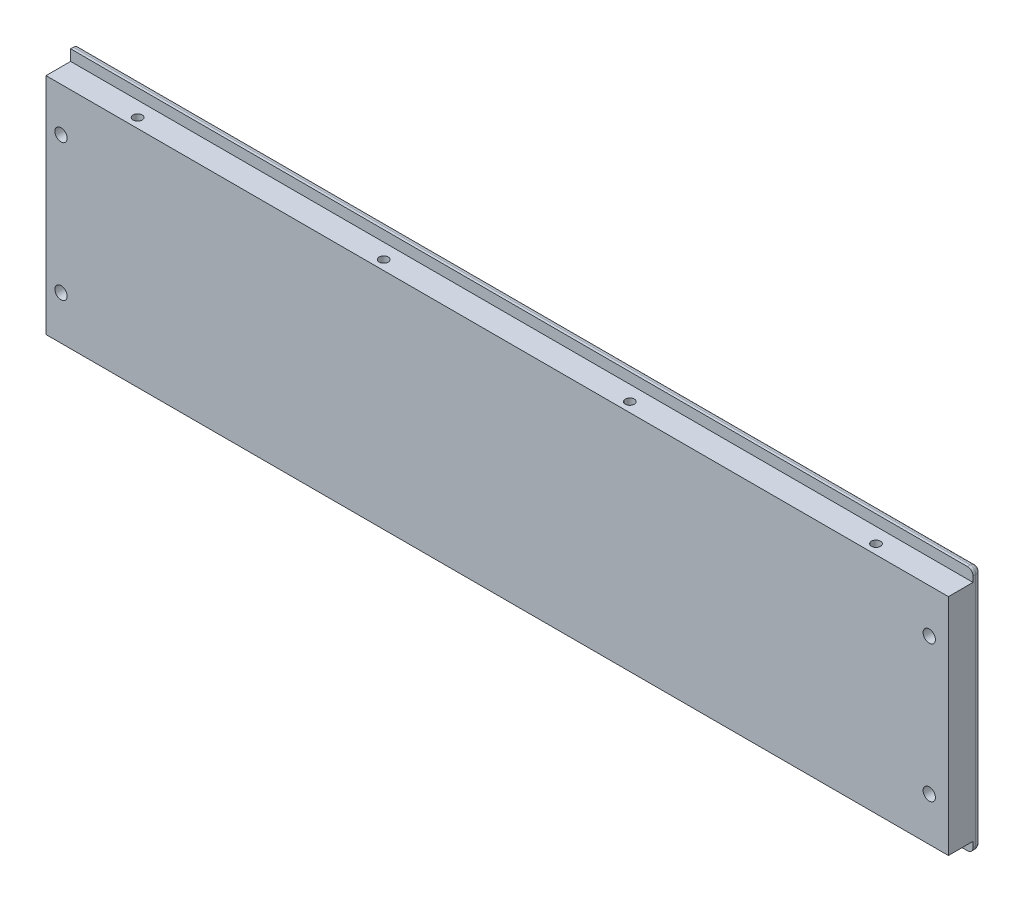
ISO-10303-21;
HEADER;
FILE_DESCRIPTION(('STEP AP214'),'2;1');
FILE_NAME('part.step','',(''),(''),'','','');
FILE_SCHEMA(('AUTOMOTIVE_DESIGN { 1 0 10303 214 1 1 1 1 }'));
ENDSEC;
DATA;
#1=APPLICATION_CONTEXT('core data for automotive mechanical design processes');
#2=APPLICATION_PROTOCOL_DEFINITION('international standard','automotive_design',2000,#1);
#3=PRODUCT_CONTEXT('',#1,'mechanical');
#4=PRODUCT('Part','Part','',(#3));
#5=PRODUCT_RELATED_PRODUCT_CATEGORY('part','',(#4));
#6=PRODUCT_DEFINITION_FORMATION('','',#4);
#7=PRODUCT_DEFINITION_CONTEXT('part definition',#1,'design');
#8=PRODUCT_DEFINITION('design','',#6,#7);
#9=PRODUCT_DEFINITION_SHAPE('','',#8);
#10=(LENGTH_UNIT() NAMED_UNIT(*) SI_UNIT(.MILLI.,.METRE.));
#11=(NAMED_UNIT(*) PLANE_ANGLE_UNIT() SI_UNIT($,.RADIAN.));
#12=(NAMED_UNIT(*) SI_UNIT($,.STERADIAN.) SOLID_ANGLE_UNIT());
#13=UNCERTAINTY_MEASURE_WITH_UNIT(LENGTH_MEASURE(1.E-05),#10,'distance_accuracy_value','');
#14=(GEOMETRIC_REPRESENTATION_CONTEXT(3) GLOBAL_UNCERTAINTY_ASSIGNED_CONTEXT((#13)) GLOBAL_UNIT_ASSIGNED_CONTEXT((#10,
#11,#12)) REPRESENTATION_CONTEXT('',''));
#15=CARTESIAN_POINT('',(0.,0.,0.));
#16=DIRECTION('',(0.,0.,1.));
#17=DIRECTION('',(1.,0.,0.));
#18=AXIS2_PLACEMENT_3D('',#15,#16,#17);
#19=CARTESIAN_POINT('',(0.,0.,12.));
#20=DIRECTION('',(1.,0.,0.));
#21=DIRECTION('',(0.,0.,-1.));
#22=AXIS2_PLACEMENT_3D('',#19,#20,#21);
#23=PLANE('',#22);
#24=DIRECTION('',(0.,-1.,0.));
#25=VECTOR('',#24,1.);
#26=CARTESIAN_POINT('',(0.,0.,0.));
#27=LINE('',#26,#25);
#28=CARTESIAN_POINT('',(0.,88.,0.));
#29=VERTEX_POINT('',#28);
#30=CARTESIAN_POINT('',(0.,2.,0.));
#31=VERTEX_POINT('',#30);
#32=EDGE_CURVE('E159',#29,#31,#27,.T.);
#33=ORIENTED_EDGE('',*,*,#32,.T.);
#34=CARTESIAN_POINT('',(0.,2.,2.));
#35=DIRECTION('',(1.,0.,0.));
#36=DIRECTION('',(0.,0.,-1.));
#37=AXIS2_PLACEMENT_3D('',#34,#35,#36);
#38=CIRCLE('',#37,2.);
#39=CARTESIAN_POINT('',(0.,0.,2.));
#40=VERTEX_POINT('',#39);
#41=EDGE_CURVE('E200',#31,#40,#38,.F.);
#42=ORIENTED_EDGE('',*,*,#41,.T.);
#43=DIRECTION('',(0.,0.,-1.));
#44=VECTOR('',#43,1.);
#45=CARTESIAN_POINT('',(0.,0.,12.));
#46=LINE('',#45,#44);
#47=CARTESIAN_POINT('',(0.,0.,3.));
#48=VERTEX_POINT('',#47);
#49=EDGE_CURVE('E188',#48,#40,#46,.T.);
#50=ORIENTED_EDGE('',*,*,#49,.F.);
#51=DIRECTION('',(0.,-1.,0.));
#52=VECTOR('',#51,1.);
#53=CARTESIAN_POINT('',(0.,0.,3.));
#54=LINE('',#53,#52);
#55=CARTESIAN_POINT('',(0.,4.,3.));
#56=VERTEX_POINT('',#55);
#57=EDGE_CURVE('E165',#56,#48,#54,.T.);
#58=ORIENTED_EDGE('',*,*,#57,.F.);
#59=DIRECTION('',(0.,0.,-1.));
#60=VECTOR('',#59,1.);
#61=CARTESIAN_POINT('',(0.,4.,12.));
#62=LINE('',#61,#60);
#63=CARTESIAN_POINT('',(0.,4.,12.));
#64=VERTEX_POINT('',#63);
#65=EDGE_CURVE('E169',#64,#56,#62,.T.);
#66=ORIENTED_EDGE('',*,*,#65,.F.);
#67=DIRECTION('',(0.,-1.,0.));
#68=VECTOR('',#67,1.);
#69=CARTESIAN_POINT('',(0.,0.,12.));
#70=LINE('',#69,#68);
#71=CARTESIAN_POINT('',(0.,86.,12.));
#72=VERTEX_POINT('',#71);
#73=EDGE_CURVE('E178',#72,#64,#70,.T.);
#74=ORIENTED_EDGE('',*,*,#73,.F.);
#75=DIRECTION('',(0.,0.,1.));
#76=VECTOR('',#75,1.);
#77=CARTESIAN_POINT('',(0.,86.,12.));
#78=LINE('',#77,#76);
#79=CARTESIAN_POINT('',(0.,86.,3.));
#80=VERTEX_POINT('',#79);
#81=EDGE_CURVE('E138',#80,#72,#78,.T.);
#82=ORIENTED_EDGE('',*,*,#81,.F.);
#83=DIRECTION('',(0.,-1.,0.));
#84=VECTOR('',#83,1.);
#85=CARTESIAN_POINT('',(0.,90.,3.));
#86=LINE('',#85,#84);
#87=CARTESIAN_POINT('',(0.,90.,3.));
#88=VERTEX_POINT('',#87);
#89=EDGE_CURVE('E144',#88,#80,#86,.T.);
#90=ORIENTED_EDGE('',*,*,#89,.F.);
#91=DIRECTION('',(0.,0.,-1.));
#92=VECTOR('',#91,1.);
#93=CARTESIAN_POINT('',(0.,90.,12.));
#94=LINE('',#93,#92);
#95=CARTESIAN_POINT('',(0.,90.,2.));
#96=VERTEX_POINT('',#95);
#97=EDGE_CURVE('E183',#88,#96,#94,.T.);
#98=ORIENTED_EDGE('',*,*,#97,.T.);
#99=CARTESIAN_POINT('',(0.,88.,2.));
#100=DIRECTION('',(1.,0.,0.));
#101=DIRECTION('',(0.,0.,-1.));
#102=AXIS2_PLACEMENT_3D('',#99,#100,#101);
#103=CIRCLE('',#102,2.);
#104=EDGE_CURVE('E198',#96,#29,#103,.F.);
#105=ORIENTED_EDGE('',*,*,#104,.T.);
#106=EDGE_LOOP('',(#33,#42,#50,#58,#66,#74,#82,#90,#98,#105));
#107=FACE_BOUND('',#106,.T.);
#108=ADVANCED_FACE('F36',(#107),#23,.F.);
#109=CARTESIAN_POINT('',(0.,0.,12.));
#110=DIRECTION('',(0.,1.,0.));
#111=DIRECTION('',(0.,0.,1.));
#112=AXIS2_PLACEMENT_3D('',#109,#110,#111);
#113=PLANE('',#112);
#114=DIRECTION('',(1.,0.,0.));
#115=VECTOR('',#114,1.);
#116=CARTESIAN_POINT('',(330.,0.,2.));
#117=LINE('',#116,#115);
#118=CARTESIAN_POINT('',(328.,0.,2.));
#119=VERTEX_POINT('',#118);
#120=EDGE_CURVE('E191',#40,#119,#117,.T.);
#121=ORIENTED_EDGE('',*,*,#120,.T.);
#122=DIRECTION('',(0.,0.,-1.));
#123=VECTOR('',#122,1.);
#124=CARTESIAN_POINT('',(328.,0.,12.));
#125=LINE('',#124,#123);
#126=CARTESIAN_POINT('',(328.,0.,3.));
#127=VERTEX_POINT('',#126);
#128=EDGE_CURVE('E45',#119,#127,#125,.F.);
#129=ORIENTED_EDGE('',*,*,#128,.T.);
#130=DIRECTION('',(-1.,0.,0.));
#131=VECTOR('',#130,1.);
#132=CARTESIAN_POINT('',(330.,0.,3.));
#133=LINE('',#132,#131);
#134=EDGE_CURVE('E157',#127,#48,#133,.T.);
#135=ORIENTED_EDGE('',*,*,#134,.T.);
#136=ORIENTED_EDGE('',*,*,#49,.T.);
#137=EDGE_LOOP('',(#121,#129,#135,#136));
#138=FACE_BOUND('',#137,.T.);
#139=ADVANCED_FACE('F252',(#138),#113,.F.);
#140=CARTESIAN_POINT('',(330.,0.,12.));
#141=DIRECTION('',(-1.,0.,0.));
#142=DIRECTION('',(0.,0.,1.));
#143=AXIS2_PLACEMENT_3D('',#140,#141,#142);
#144=PLANE('',#143);
#145=DIRECTION('',(0.,1.,0.));
#146=VECTOR('',#145,1.);
#147=CARTESIAN_POINT('',(330.,88.,2.));
#148=LINE('',#147,#146);
#149=CARTESIAN_POINT('',(330.,2.,2.));
#150=VERTEX_POINT('',#149);
#151=CARTESIAN_POINT('',(330.,88.,2.));
#152=VERTEX_POINT('',#151);
#153=EDGE_CURVE('E209',#150,#152,#148,.T.);
#154=ORIENTED_EDGE('',*,*,#153,.T.);
#155=DIRECTION('',(0.,0.,-1.));
#156=VECTOR('',#155,1.);
#157=CARTESIAN_POINT('',(330.,88.,12.));
#158=LINE('',#157,#156);
#159=CARTESIAN_POINT('',(330.,88.,3.));
#160=VERTEX_POINT('',#159);
#161=EDGE_CURVE('E135',#152,#160,#158,.F.);
#162=ORIENTED_EDGE('',*,*,#161,.T.);
#163=DIRECTION('',(0.,-1.,0.));
#164=VECTOR('',#163,1.);
#165=CARTESIAN_POINT('',(330.,90.,3.));
#166=LINE('',#165,#164);
#167=CARTESIAN_POINT('',(330.,86.,3.));
#168=VERTEX_POINT('',#167);
#169=EDGE_CURVE('E127',#160,#168,#166,.T.);
#170=ORIENTED_EDGE('',*,*,#169,.T.);
#171=DIRECTION('',(0.,0.,1.));
#172=VECTOR('',#171,1.);
#173=CARTESIAN_POINT('',(330.,86.,12.));
#174=LINE('',#173,#172);
#175=CARTESIAN_POINT('',(330.,86.,12.));
#176=VERTEX_POINT('',#175);
#177=EDGE_CURVE('E132',#168,#176,#174,.T.);
#178=ORIENTED_EDGE('',*,*,#177,.T.);
#179=DIRECTION('',(0.,1.,0.));
#180=VECTOR('',#179,1.);
#181=CARTESIAN_POINT('',(330.,0.,12.));
#182=LINE('',#181,#180);
#183=CARTESIAN_POINT('',(330.,4.,12.));
#184=VERTEX_POINT('',#183);
#185=EDGE_CURVE('E181',#184,#176,#182,.T.);
#186=ORIENTED_EDGE('',*,*,#185,.F.);
#187=DIRECTION('',(0.,0.,-1.));
#188=VECTOR('',#187,1.);
#189=CARTESIAN_POINT('',(330.,4.,12.));
#190=LINE('',#189,#188);
#191=CARTESIAN_POINT('',(330.,4.,3.));
#192=VERTEX_POINT('',#191);
#193=EDGE_CURVE('E161',#184,#192,#190,.T.);
#194=ORIENTED_EDGE('',*,*,#193,.T.);
#195=DIRECTION('',(0.,-1.,0.));
#196=VECTOR('',#195,1.);
#197=CARTESIAN_POINT('',(330.,0.,3.));
#198=LINE('',#197,#196);
#199=CARTESIAN_POINT('',(330.,2.,3.));
#200=VERTEX_POINT('',#199);
#201=EDGE_CURVE('E164',#192,#200,#198,.T.);
#202=ORIENTED_EDGE('',*,*,#201,.T.);
#203=DIRECTION('',(0.,0.,-1.));
#204=VECTOR('',#203,1.);
#205=CARTESIAN_POINT('',(330.,2.,12.));
#206=LINE('',#205,#204);
#207=EDGE_CURVE('E207',#200,#150,#206,.T.);
#208=ORIENTED_EDGE('',*,*,#207,.T.);
#209=EDGE_LOOP('',(#154,#162,#170,#178,#186,#194,#202,#208));
#210=FACE_BOUND('',#209,.T.);
#211=ADVANCED_FACE('F129',(#210),#144,.F.);
#212=CARTESIAN_POINT('',(0.,90.,12.));
#213=DIRECTION('',(0.,-1.,0.));
#214=DIRECTION('',(0.,0.,-1.));
#215=AXIS2_PLACEMENT_3D('',#212,#213,#214);
#216=PLANE('',#215);
#217=DIRECTION('',(-1.,0.,0.));
#218=VECTOR('',#217,1.);
#219=CARTESIAN_POINT('',(330.,90.,3.));
#220=LINE('',#219,#218);
#221=CARTESIAN_POINT('',(328.,90.,3.));
#222=VERTEX_POINT('',#221);
#223=EDGE_CURVE('E148',#222,#88,#220,.T.);
#224=ORIENTED_EDGE('',*,*,#223,.F.);
#225=DIRECTION('',(0.,0.,-1.));
#226=VECTOR('',#225,1.);
#227=CARTESIAN_POINT('',(328.,90.,12.));
#228=LINE('',#227,#226);
#229=CARTESIAN_POINT('',(328.,90.,2.));
#230=VERTEX_POINT('',#229);
#231=EDGE_CURVE('E204',#222,#230,#228,.T.);
#232=ORIENTED_EDGE('',*,*,#231,.T.);
#233=DIRECTION('',(-1.,0.,0.));
#234=VECTOR('',#233,1.);
#235=CARTESIAN_POINT('',(0.,90.,2.));
#236=LINE('',#235,#234);
#237=EDGE_CURVE('E202',#230,#96,#236,.T.);
#238=ORIENTED_EDGE('',*,*,#237,.T.);
#239=ORIENTED_EDGE('',*,*,#97,.F.);
#240=EDGE_LOOP('',(#224,#232,#238,#239));
#241=FACE_BOUND('',#240,.T.);
#242=ADVANCED_FACE('F274',(#241),#216,.F.);
#243=CARTESIAN_POINT('',(0.,0.,12.));
#244=DIRECTION('',(0.,0.,-1.));
#245=DIRECTION('',(-1.,0.,0.));
#246=AXIS2_PLACEMENT_3D('',#243,#244,#245);
#247=PLANE('',#246);
#248=CARTESIAN_POINT('',(323.,20.,12.));
#249=DIRECTION('',(0.,0.,-1.));
#250=DIRECTION('',(-1.,0.,0.));
#251=AXIS2_PLACEMENT_3D('',#248,#249,#250);
#252=CIRCLE('',#251,2.24999999999997);
#253=CARTESIAN_POINT('',(320.75,20.,12.));
#254=VERTEX_POINT('',#253);
#255=EDGE_CURVE('E495',#254,#254,#252,.T.);
#256=ORIENTED_EDGE('',*,*,#255,.T.);
#257=EDGE_LOOP('',(#256));
#258=FACE_BOUND('',#257,.T.);
#259=CARTESIAN_POINT('',(323.,70.,12.));
#260=DIRECTION('',(0.,0.,-1.));
#261=DIRECTION('',(-1.,0.,0.));
#262=AXIS2_PLACEMENT_3D('',#259,#260,#261);
#263=CIRCLE('',#262,2.24999999999997);
#264=CARTESIAN_POINT('',(320.75,70.,12.));
#265=VERTEX_POINT('',#264);
#266=EDGE_CURVE('E506',#265,#265,#263,.T.);
#267=ORIENTED_EDGE('',*,*,#266,.T.);
#268=EDGE_LOOP('',(#267));
#269=FACE_BOUND('',#268,.T.);
#270=CARTESIAN_POINT('',(5.5,20.,12.));
#271=DIRECTION('',(0.,0.,-1.));
#272=DIRECTION('',(-1.,0.,0.));
#273=AXIS2_PLACEMENT_3D('',#270,#271,#272);
#274=CIRCLE('',#273,2.25);
#275=CARTESIAN_POINT('',(3.25,20.,12.));
#276=VERTEX_POINT('',#275);
#277=EDGE_CURVE('E515',#276,#276,#274,.T.);
#278=ORIENTED_EDGE('',*,*,#277,.T.);
#279=EDGE_LOOP('',(#278));
#280=FACE_BOUND('',#279,.T.);
#281=CARTESIAN_POINT('',(5.5,70.,12.));
#282=DIRECTION('',(0.,0.,-1.));
#283=DIRECTION('',(-1.,0.,0.));
#284=AXIS2_PLACEMENT_3D('',#281,#282,#283);
#285=CIRCLE('',#284,2.25);
#286=CARTESIAN_POINT('',(3.25,70.,12.));
#287=VERTEX_POINT('',#286);
#288=EDGE_CURVE('E524',#287,#287,#285,.T.);
#289=ORIENTED_EDGE('',*,*,#288,.T.);
#290=EDGE_LOOP('',(#289));
#291=FACE_BOUND('',#290,.T.);
#292=ORIENTED_EDGE('',*,*,#185,.T.);
#293=DIRECTION('',(-1.,0.,0.));
#294=VECTOR('',#293,1.);
#295=CARTESIAN_POINT('',(330.,86.,12.));
#296=LINE('',#295,#294);
#297=EDGE_CURVE('E147',#176,#72,#296,.T.);
#298=ORIENTED_EDGE('',*,*,#297,.T.);
#299=ORIENTED_EDGE('',*,*,#73,.T.);
#300=DIRECTION('',(-1.,0.,0.));
#301=VECTOR('',#300,1.);
#302=CARTESIAN_POINT('',(330.,4.,12.));
#303=LINE('',#302,#301);
#304=EDGE_CURVE('E168',#184,#64,#303,.T.);
#305=ORIENTED_EDGE('',*,*,#304,.F.);
#306=EDGE_LOOP('',(#292,#298,#299,#305));
#307=FACE_BOUND('',#306,.T.);
#308=ADVANCED_FACE('F246',(#258,#269,#280,#291,#307),#247,.F.);
#309=CARTESIAN_POINT('',(0.,0.,0.));
#310=DIRECTION('',(0.,0.,-1.));
#311=DIRECTION('',(-1.,0.,0.));
#312=AXIS2_PLACEMENT_3D('',#309,#310,#311);
#313=PLANE('',#312);
#314=CARTESIAN_POINT('',(323.,20.,0.));
#315=DIRECTION('',(0.,0.,-1.));
#316=DIRECTION('',(-1.,0.,0.));
#317=AXIS2_PLACEMENT_3D('',#314,#315,#316);
#318=CIRCLE('',#317,4.69999999999998);
#319=CARTESIAN_POINT('',(318.3,20.,0.));
#320=VERTEX_POINT('',#319);
#321=EDGE_CURVE('E493',#320,#320,#318,.T.);
#322=ORIENTED_EDGE('',*,*,#321,.F.);
#323=EDGE_LOOP('',(#322));
#324=FACE_BOUND('',#323,.T.);
#325=CARTESIAN_POINT('',(323.,70.,0.));
#326=DIRECTION('',(0.,0.,-1.));
#327=DIRECTION('',(-1.,0.,0.));
#328=AXIS2_PLACEMENT_3D('',#325,#326,#327);
#329=CIRCLE('',#328,4.69999999999998);
#330=CARTESIAN_POINT('',(318.3,70.,0.));
#331=VERTEX_POINT('',#330);
#332=EDGE_CURVE('E500',#331,#331,#329,.T.);
#333=ORIENTED_EDGE('',*,*,#332,.F.);
#334=EDGE_LOOP('',(#333));
#335=FACE_BOUND('',#334,.T.);
#336=CARTESIAN_POINT('',(5.5,20.,0.));
#337=DIRECTION('',(0.,0.,-1.));
#338=DIRECTION('',(-1.,0.,0.));
#339=AXIS2_PLACEMENT_3D('',#336,#337,#338);
#340=CIRCLE('',#339,4.7);
#341=CARTESIAN_POINT('',(0.8,20.,0.));
#342=VERTEX_POINT('',#341);
#343=EDGE_CURVE('E509',#342,#342,#340,.T.);
#344=ORIENTED_EDGE('',*,*,#343,.F.);
#345=EDGE_LOOP('',(#344));
#346=FACE_BOUND('',#345,.T.);
#347=CARTESIAN_POINT('',(5.5,70.,0.));
#348=DIRECTION('',(0.,0.,-1.));
#349=DIRECTION('',(-1.,0.,0.));
#350=AXIS2_PLACEMENT_3D('',#347,#348,#349);
#351=CIRCLE('',#350,4.7);
#352=CARTESIAN_POINT('',(0.8,70.,0.));
#353=VERTEX_POINT('',#352);
#354=EDGE_CURVE('E518',#353,#353,#351,.T.);
#355=ORIENTED_EDGE('',*,*,#354,.F.);
#356=EDGE_LOOP('',(#355));
#357=FACE_BOUND('',#356,.T.);
#358=DIRECTION('',(-1.,0.,0.));
#359=VECTOR('',#358,1.);
#360=CARTESIAN_POINT('',(330.,88.,0.));
#361=LINE('',#360,#359);
#362=CARTESIAN_POINT('',(328.,88.,0.));
#363=VERTEX_POINT('',#362);
#364=EDGE_CURVE('E193',#29,#363,#361,.F.);
#365=ORIENTED_EDGE('',*,*,#364,.T.);
#366=DIRECTION('',(0.,1.,0.));
#367=VECTOR('',#366,1.);
#368=CARTESIAN_POINT('',(328.,2.,0.));
#369=LINE('',#368,#367);
#370=CARTESIAN_POINT('',(328.,2.,0.));
#371=VERTEX_POINT('',#370);
#372=EDGE_CURVE('E216',#363,#371,#369,.F.);
#373=ORIENTED_EDGE('',*,*,#372,.T.);
#374=DIRECTION('',(1.,0.,0.));
#375=VECTOR('',#374,1.);
#376=CARTESIAN_POINT('',(0.,2.,0.));
#377=LINE('',#376,#375);
#378=EDGE_CURVE('E196',#371,#31,#377,.F.);
#379=ORIENTED_EDGE('',*,*,#378,.T.);
#380=ORIENTED_EDGE('',*,*,#32,.F.);
#381=EDGE_LOOP('',(#365,#373,#379,#380));
#382=FACE_BOUND('',#381,.T.);
#383=ADVANCED_FACE('F256',(#324,#335,#346,#357,#382),#313,.T.);
#384=CARTESIAN_POINT('',(330.,0.,3.));
#385=DIRECTION('',(0.,0.,-1.));
#386=DIRECTION('',(-1.,0.,0.));
#387=AXIS2_PLACEMENT_3D('',#384,#385,#386);
#388=PLANE('',#387);
#389=ORIENTED_EDGE('',*,*,#134,.F.);
#390=CARTESIAN_POINT('',(328.,2.,3.));
#391=DIRECTION('',(0.,0.,-1.));
#392=DIRECTION('',(-1.,0.,0.));
#393=AXIS2_PLACEMENT_3D('',#390,#391,#392);
#394=CIRCLE('',#393,2.);
#395=EDGE_CURVE('E11',#127,#200,#394,.F.);
#396=ORIENTED_EDGE('',*,*,#395,.T.);
#397=ORIENTED_EDGE('',*,*,#201,.F.);
#398=DIRECTION('',(-1.,0.,0.));
#399=VECTOR('',#398,1.);
#400=CARTESIAN_POINT('',(330.,4.,3.));
#401=LINE('',#400,#399);
#402=EDGE_CURVE('E175',#192,#56,#401,.T.);
#403=ORIENTED_EDGE('',*,*,#402,.T.);
#404=ORIENTED_EDGE('',*,*,#57,.T.);
#405=EDGE_LOOP('',(#389,#396,#397,#403,#404));
#406=FACE_BOUND('',#405,.T.);
#407=ADVANCED_FACE('F240',(#406),#388,.F.);
#408=CARTESIAN_POINT('',(330.,4.,12.));
#409=DIRECTION('',(0.,1.,0.));
#410=DIRECTION('',(0.,0.,1.));
#411=AXIS2_PLACEMENT_3D('',#408,#409,#410);
#412=PLANE('',#411);
#413=CARTESIAN_POINT('',(30.,4.,8.5));
#414=DIRECTION('',(0.,1.,0.));
#415=DIRECTION('',(0.,0.,1.));
#416=AXIS2_PLACEMENT_3D('',#413,#414,#415);
#417=CIRCLE('',#416,1.64999999999998);
#418=CARTESIAN_POINT('',(30.,4.,10.15));
#419=VERTEX_POINT('',#418);
#420=EDGE_CURVE('E530',#419,#419,#417,.T.);
#421=ORIENTED_EDGE('',*,*,#420,.T.);
#422=EDGE_LOOP('',(#421));
#423=FACE_BOUND('',#422,.T.);
#424=CARTESIAN_POINT('',(120.,4.,8.5));
#425=DIRECTION('',(0.,1.,0.));
#426=DIRECTION('',(0.,0.,1.));
#427=AXIS2_PLACEMENT_3D('',#424,#425,#426);
#428=CIRCLE('',#427,1.64999999999998);
#429=CARTESIAN_POINT('',(120.,4.,10.15));
#430=VERTEX_POINT('',#429);
#431=EDGE_CURVE('E536',#430,#430,#428,.T.);
#432=ORIENTED_EDGE('',*,*,#431,.T.);
#433=EDGE_LOOP('',(#432));
#434=FACE_BOUND('',#433,.T.);
#435=CARTESIAN_POINT('',(210.,4.,8.5));
#436=DIRECTION('',(0.,1.,0.));
#437=DIRECTION('',(0.,0.,1.));
#438=AXIS2_PLACEMENT_3D('',#435,#436,#437);
#439=CIRCLE('',#438,1.64999999999998);
#440=CARTESIAN_POINT('',(210.,4.,10.15));
#441=VERTEX_POINT('',#440);
#442=EDGE_CURVE('E542',#441,#441,#439,.T.);
#443=ORIENTED_EDGE('',*,*,#442,.T.);
#444=EDGE_LOOP('',(#443));
#445=FACE_BOUND('',#444,.T.);
#446=CARTESIAN_POINT('',(300.,4.,8.5));
#447=DIRECTION('',(0.,1.,0.));
#448=DIRECTION('',(0.,0.,1.));
#449=AXIS2_PLACEMENT_3D('',#446,#447,#448);
#450=CIRCLE('',#449,1.64999999999998);
#451=CARTESIAN_POINT('',(300.,4.,10.15));
#452=VERTEX_POINT('',#451);
#453=EDGE_CURVE('E223',#452,#452,#450,.T.);
#454=ORIENTED_EDGE('',*,*,#453,.T.);
#455=EDGE_LOOP('',(#454));
#456=FACE_BOUND('',#455,.T.);
#457=ORIENTED_EDGE('',*,*,#65,.T.);
#458=ORIENTED_EDGE('',*,*,#402,.F.);
#459=ORIENTED_EDGE('',*,*,#193,.F.);
#460=ORIENTED_EDGE('',*,*,#304,.T.);
#461=EDGE_LOOP('',(#457,#458,#459,#460));
#462=FACE_BOUND('',#461,.T.);
#463=ADVANCED_FACE('F243',(#423,#434,#445,#456,#462),#412,.F.);
#464=CARTESIAN_POINT('',(330.,86.,12.));
#465=DIRECTION('',(0.,-1.,0.));
#466=DIRECTION('',(0.,0.,-1.));
#467=AXIS2_PLACEMENT_3D('',#464,#465,#466);
#468=PLANE('',#467);
#469=CARTESIAN_POINT('',(30.,86.,8.5));
#470=DIRECTION('',(0.,1.,0.));
#471=DIRECTION('',(0.,0.,1.));
#472=AXIS2_PLACEMENT_3D('',#469,#470,#471);
#473=CIRCLE('',#472,1.64999999999998);
#474=CARTESIAN_POINT('',(30.,86.,10.15));
#475=VERTEX_POINT('',#474);
#476=EDGE_CURVE('E527',#475,#475,#473,.T.);
#477=ORIENTED_EDGE('',*,*,#476,.F.);
#478=EDGE_LOOP('',(#477));
#479=FACE_BOUND('',#478,.T.);
#480=CARTESIAN_POINT('',(120.,86.,8.5));
#481=DIRECTION('',(0.,1.,0.));
#482=DIRECTION('',(0.,0.,1.));
#483=AXIS2_PLACEMENT_3D('',#480,#481,#482);
#484=CIRCLE('',#483,1.64999999999998);
#485=CARTESIAN_POINT('',(120.,86.,10.15));
#486=VERTEX_POINT('',#485);
#487=EDGE_CURVE('E533',#486,#486,#484,.T.);
#488=ORIENTED_EDGE('',*,*,#487,.F.);
#489=EDGE_LOOP('',(#488));
#490=FACE_BOUND('',#489,.T.);
#491=CARTESIAN_POINT('',(210.,86.,8.5));
#492=DIRECTION('',(0.,1.,0.));
#493=DIRECTION('',(0.,0.,1.));
#494=AXIS2_PLACEMENT_3D('',#491,#492,#493);
#495=CIRCLE('',#494,1.64999999999998);
#496=CARTESIAN_POINT('',(210.,86.,10.15));
#497=VERTEX_POINT('',#496);
#498=EDGE_CURVE('E539',#497,#497,#495,.T.);
#499=ORIENTED_EDGE('',*,*,#498,.F.);
#500=EDGE_LOOP('',(#499));
#501=FACE_BOUND('',#500,.T.);
#502=CARTESIAN_POINT('',(300.,86.,8.5));
#503=DIRECTION('',(0.,1.,0.));
#504=DIRECTION('',(0.,0.,1.));
#505=AXIS2_PLACEMENT_3D('',#502,#503,#504);
#506=CIRCLE('',#505,1.64999999999998);
#507=CARTESIAN_POINT('',(300.,86.,10.15));
#508=VERTEX_POINT('',#507);
#509=EDGE_CURVE('E545',#508,#508,#506,.T.);
#510=ORIENTED_EDGE('',*,*,#509,.F.);
#511=EDGE_LOOP('',(#510));
#512=FACE_BOUND('',#511,.T.);
#513=ORIENTED_EDGE('',*,*,#81,.T.);
#514=ORIENTED_EDGE('',*,*,#297,.F.);
#515=ORIENTED_EDGE('',*,*,#177,.F.);
#516=DIRECTION('',(-1.,0.,0.));
#517=VECTOR('',#516,1.);
#518=CARTESIAN_POINT('',(330.,86.,3.));
#519=LINE('',#518,#517);
#520=EDGE_CURVE('E141',#168,#80,#519,.T.);
#521=ORIENTED_EDGE('',*,*,#520,.T.);
#522=EDGE_LOOP('',(#513,#514,#515,#521));
#523=FACE_BOUND('',#522,.T.);
#524=ADVANCED_FACE('F150',(#479,#490,#501,#512,#523),#468,.F.);
#525=CARTESIAN_POINT('',(330.,90.,3.));
#526=DIRECTION('',(0.,0.,-1.));
#527=DIRECTION('',(-1.,0.,0.));
#528=AXIS2_PLACEMENT_3D('',#525,#526,#527);
#529=PLANE('',#528);
#530=ORIENTED_EDGE('',*,*,#169,.F.);
#531=CARTESIAN_POINT('',(328.,88.,3.));
#532=DIRECTION('',(0.,0.,-1.));
#533=DIRECTION('',(-1.,0.,0.));
#534=AXIS2_PLACEMENT_3D('',#531,#532,#533);
#535=CIRCLE('',#534,2.);
#536=EDGE_CURVE('E212',#160,#222,#535,.F.);
#537=ORIENTED_EDGE('',*,*,#536,.T.);
#538=ORIENTED_EDGE('',*,*,#223,.T.);
#539=ORIENTED_EDGE('',*,*,#89,.T.);
#540=ORIENTED_EDGE('',*,*,#520,.F.);
#541=EDGE_LOOP('',(#530,#537,#538,#539,#540));
#542=FACE_BOUND('',#541,.T.);
#543=ADVANCED_FACE('F142',(#542),#529,.F.);
#544=CARTESIAN_POINT('',(0.,2.,2.));
#545=DIRECTION('',(-1.,0.,0.));
#546=DIRECTION('',(0.,0.,1.));
#547=AXIS2_PLACEMENT_3D('',#544,#545,#546);
#548=CYLINDRICAL_SURFACE('',#547,2.);
#549=ORIENTED_EDGE('',*,*,#378,.F.);
#550=CARTESIAN_POINT('',(328.,2.,2.));
#551=DIRECTION('',(-1.,0.,0.));
#552=DIRECTION('',(0.,0.,1.));
#553=AXIS2_PLACEMENT_3D('',#550,#551,#552);
#554=CIRCLE('',#553,2.);
#555=EDGE_CURVE('E60',#371,#119,#554,.T.);
#556=ORIENTED_EDGE('',*,*,#555,.T.);
#557=ORIENTED_EDGE('',*,*,#120,.F.);
#558=ORIENTED_EDGE('',*,*,#41,.F.);
#559=EDGE_LOOP('',(#549,#556,#557,#558));
#560=FACE_BOUND('',#559,.T.);
#561=ADVANCED_FACE('F253',(#560),#548,.T.);
#562=CARTESIAN_POINT('',(0.,88.,2.));
#563=DIRECTION('',(1.,0.,0.));
#564=DIRECTION('',(0.,0.,-1.));
#565=AXIS2_PLACEMENT_3D('',#562,#563,#564);
#566=CYLINDRICAL_SURFACE('',#565,2.);
#567=ORIENTED_EDGE('',*,*,#237,.F.);
#568=CARTESIAN_POINT('',(328.,88.,2.));
#569=DIRECTION('',(1.,0.,0.));
#570=DIRECTION('',(0.,0.,-1.));
#571=AXIS2_PLACEMENT_3D('',#568,#569,#570);
#572=CIRCLE('',#571,2.);
#573=EDGE_CURVE('E214',#230,#363,#572,.F.);
#574=ORIENTED_EDGE('',*,*,#573,.T.);
#575=ORIENTED_EDGE('',*,*,#364,.F.);
#576=ORIENTED_EDGE('',*,*,#104,.F.);
#577=EDGE_LOOP('',(#567,#574,#575,#576));
#578=FACE_BOUND('',#577,.T.);
#579=ADVANCED_FACE('F262',(#578),#566,.T.);
#580=CARTESIAN_POINT('',(328.,2.,12.));
#581=DIRECTION('',(0.,0.,-1.));
#582=DIRECTION('',(-1.,0.,0.));
#583=AXIS2_PLACEMENT_3D('',#580,#581,#582);
#584=CYLINDRICAL_SURFACE('',#583,2.);
#585=ORIENTED_EDGE('',*,*,#395,.F.);
#586=ORIENTED_EDGE('',*,*,#128,.F.);
#587=CARTESIAN_POINT('',(328.,2.,2.));
#588=DIRECTION('',(0.,0.,-1.));
#589=DIRECTION('',(-1.,0.,0.));
#590=AXIS2_PLACEMENT_3D('',#587,#588,#589);
#591=CIRCLE('',#590,2.);
#592=EDGE_CURVE('E40',#150,#119,#591,.T.);
#593=ORIENTED_EDGE('',*,*,#592,.F.);
#594=ORIENTED_EDGE('',*,*,#207,.F.);
#595=EDGE_LOOP('',(#585,#586,#593,#594));
#596=FACE_BOUND('',#595,.T.);
#597=ADVANCED_FACE('F38',(#596),#584,.T.);
#598=CARTESIAN_POINT('',(328.,2.,2.));
#599=DIRECTION('',(-1.,0.,0.));
#600=DIRECTION('',(0.,0.,1.));
#601=AXIS2_PLACEMENT_3D('',#598,#599,#600);
#602=SPHERICAL_SURFACE('',#601,2.);
#603=ORIENTED_EDGE('',*,*,#592,.T.);
#604=ORIENTED_EDGE('',*,*,#555,.F.);
#605=CARTESIAN_POINT('',(328.,2.,2.));
#606=DIRECTION('',(0.,1.,0.));
#607=DIRECTION('',(0.,0.,1.));
#608=AXIS2_PLACEMENT_3D('',#605,#606,#607);
#609=CIRCLE('',#608,2.);
#610=EDGE_CURVE('E225',#150,#371,#609,.T.);
#611=ORIENTED_EDGE('',*,*,#610,.F.);
#612=EDGE_LOOP('',(#603,#604,#611));
#613=FACE_BOUND('',#612,.T.);
#614=ADVANCED_FACE('F234',(#613),#602,.T.);
#615=CARTESIAN_POINT('',(328.,0.,2.));
#616=DIRECTION('',(0.,-1.,0.));
#617=DIRECTION('',(0.,0.,-1.));
#618=AXIS2_PLACEMENT_3D('',#615,#616,#617);
#619=CYLINDRICAL_SURFACE('',#618,2.);
#620=ORIENTED_EDGE('',*,*,#610,.T.);
#621=ORIENTED_EDGE('',*,*,#372,.F.);
#622=CARTESIAN_POINT('',(328.,88.,2.));
#623=DIRECTION('',(0.,1.,0.));
#624=DIRECTION('',(0.,0.,1.));
#625=AXIS2_PLACEMENT_3D('',#622,#623,#624);
#626=CIRCLE('',#625,2.);
#627=EDGE_CURVE('E222',#152,#363,#626,.T.);
#628=ORIENTED_EDGE('',*,*,#627,.F.);
#629=ORIENTED_EDGE('',*,*,#153,.F.);
#630=EDGE_LOOP('',(#620,#621,#628,#629));
#631=FACE_BOUND('',#630,.T.);
#632=ADVANCED_FACE('F265',(#631),#619,.T.);
#633=CARTESIAN_POINT('',(328.,88.,2.));
#634=DIRECTION('',(-1.,0.,0.));
#635=DIRECTION('',(0.,0.,1.));
#636=AXIS2_PLACEMENT_3D('',#633,#634,#635);
#637=SPHERICAL_SURFACE('',#636,2.);
#638=ORIENTED_EDGE('',*,*,#627,.T.);
#639=ORIENTED_EDGE('',*,*,#573,.F.);
#640=CARTESIAN_POINT('',(328.,88.,2.));
#641=DIRECTION('',(0.,0.,1.));
#642=DIRECTION('',(1.,0.,0.));
#643=AXIS2_PLACEMENT_3D('',#640,#641,#642);
#644=CIRCLE('',#643,2.);
#645=EDGE_CURVE('E220',#152,#230,#644,.T.);
#646=ORIENTED_EDGE('',*,*,#645,.F.);
#647=EDGE_LOOP('',(#638,#639,#646));
#648=FACE_BOUND('',#647,.T.);
#649=ADVANCED_FACE('F268',(#648),#637,.T.);
#650=CARTESIAN_POINT('',(328.,88.,12.));
#651=DIRECTION('',(0.,0.,-1.));
#652=DIRECTION('',(-1.,0.,0.));
#653=AXIS2_PLACEMENT_3D('',#650,#651,#652);
#654=CYLINDRICAL_SURFACE('',#653,2.);
#655=ORIENTED_EDGE('',*,*,#536,.F.);
#656=ORIENTED_EDGE('',*,*,#161,.F.);
#657=ORIENTED_EDGE('',*,*,#645,.T.);
#658=ORIENTED_EDGE('',*,*,#231,.F.);
#659=EDGE_LOOP('',(#655,#656,#657,#658));
#660=FACE_BOUND('',#659,.T.);
#661=ADVANCED_FACE('F271',(#660),#654,.T.);
#662=CARTESIAN_POINT('',(300.,86.,8.5));
#663=DIRECTION('',(0.,1.,0.));
#664=DIRECTION('',(0.,0.,1.));
#665=AXIS2_PLACEMENT_3D('',#662,#663,#664);
#666=CYLINDRICAL_SURFACE('',#665,1.64999999999998);
#667=ORIENTED_EDGE('',*,*,#509,.T.);
#668=EDGE_LOOP('',(#667));
#669=FACE_BOUND('',#668,.T.);
#670=ORIENTED_EDGE('',*,*,#453,.F.);
#671=EDGE_LOOP('',(#670));
#672=FACE_BOUND('',#671,.T.);
#673=ADVANCED_FACE('F298',(#669,#672),#666,.F.);
#674=CARTESIAN_POINT('',(210.,86.,8.5));
#675=DIRECTION('',(0.,1.,0.));
#676=DIRECTION('',(0.,0.,1.));
#677=AXIS2_PLACEMENT_3D('',#674,#675,#676);
#678=CYLINDRICAL_SURFACE('',#677,1.64999999999998);
#679=ORIENTED_EDGE('',*,*,#498,.T.);
#680=EDGE_LOOP('',(#679));
#681=FACE_BOUND('',#680,.T.);
#682=ORIENTED_EDGE('',*,*,#442,.F.);
#683=EDGE_LOOP('',(#682));
#684=FACE_BOUND('',#683,.T.);
#685=ADVANCED_FACE('F380',(#681,#684),#678,.F.);
#686=CARTESIAN_POINT('',(120.,86.,8.5));
#687=DIRECTION('',(0.,1.,0.));
#688=DIRECTION('',(0.,0.,1.));
#689=AXIS2_PLACEMENT_3D('',#686,#687,#688);
#690=CYLINDRICAL_SURFACE('',#689,1.64999999999998);
#691=ORIENTED_EDGE('',*,*,#487,.T.);
#692=EDGE_LOOP('',(#691));
#693=FACE_BOUND('',#692,.T.);
#694=ORIENTED_EDGE('',*,*,#431,.F.);
#695=EDGE_LOOP('',(#694));
#696=FACE_BOUND('',#695,.T.);
#697=ADVANCED_FACE('F368',(#693,#696),#690,.F.);
#698=CARTESIAN_POINT('',(30.,86.,8.5));
#699=DIRECTION('',(0.,1.,0.));
#700=DIRECTION('',(0.,0.,1.));
#701=AXIS2_PLACEMENT_3D('',#698,#699,#700);
#702=CYLINDRICAL_SURFACE('',#701,1.64999999999998);
#703=ORIENTED_EDGE('',*,*,#476,.T.);
#704=EDGE_LOOP('',(#703));
#705=FACE_BOUND('',#704,.T.);
#706=ORIENTED_EDGE('',*,*,#420,.F.);
#707=EDGE_LOOP('',(#706));
#708=FACE_BOUND('',#707,.T.);
#709=ADVANCED_FACE('F361',(#705,#708),#702,.F.);
#710=CARTESIAN_POINT('',(5.5,70.,0.));
#711=DIRECTION('',(0.,0.,-1.));
#712=DIRECTION('',(-1.,0.,0.));
#713=AXIS2_PLACEMENT_3D('',#710,#711,#712);
#714=CYLINDRICAL_SURFACE('',#713,2.24999999999999);
#715=ORIENTED_EDGE('',*,*,#288,.F.);
#716=EDGE_LOOP('',(#715));
#717=FACE_BOUND('',#716,.T.);
#718=CARTESIAN_POINT('',(5.5,70.,2.45000000000001));
#719=DIRECTION('',(0.,0.,-1.));
#720=DIRECTION('',(-1.,0.,0.));
#721=AXIS2_PLACEMENT_3D('',#718,#719,#720);
#722=CIRCLE('',#721,2.24999999999999);
#723=CARTESIAN_POINT('',(3.25000000000001,70.,2.45000000000001));
#724=VERTEX_POINT('',#723);
#725=EDGE_CURVE('E521',#724,#724,#722,.T.);
#726=ORIENTED_EDGE('',*,*,#725,.T.);
#727=EDGE_LOOP('',(#726));
#728=FACE_BOUND('',#727,.T.);
#729=ADVANCED_FACE('F367',(#717,#728),#714,.F.);
#730=CARTESIAN_POINT('',(5.5,70.,0.));
#731=DIRECTION('',(0.,0.,-1.));
#732=DIRECTION('',(-1.,0.,0.));
#733=AXIS2_PLACEMENT_3D('',#730,#731,#732);
#734=CONICAL_SURFACE('',#733,4.7,0.785398163397449);
#735=ORIENTED_EDGE('',*,*,#725,.F.);
#736=EDGE_LOOP('',(#735));
#737=FACE_BOUND('',#736,.T.);
#738=ORIENTED_EDGE('',*,*,#354,.T.);
#739=EDGE_LOOP('',(#738));
#740=FACE_BOUND('',#739,.T.);
#741=ADVANCED_FACE('F413',(#737,#740),#734,.F.);
#742=CARTESIAN_POINT('',(5.5,20.,0.));
#743=DIRECTION('',(0.,0.,-1.));
#744=DIRECTION('',(-1.,0.,0.));
#745=AXIS2_PLACEMENT_3D('',#742,#743,#744);
#746=CYLINDRICAL_SURFACE('',#745,2.24999999999999);
#747=ORIENTED_EDGE('',*,*,#277,.F.);
#748=EDGE_LOOP('',(#747));
#749=FACE_BOUND('',#748,.T.);
#750=CARTESIAN_POINT('',(5.5,20.,2.45000000000001));
#751=DIRECTION('',(0.,0.,-1.));
#752=DIRECTION('',(-1.,0.,0.));
#753=AXIS2_PLACEMENT_3D('',#750,#751,#752);
#754=CIRCLE('',#753,2.24999999999999);
#755=CARTESIAN_POINT('',(3.25000000000001,20.,2.45000000000001));
#756=VERTEX_POINT('',#755);
#757=EDGE_CURVE('E512',#756,#756,#754,.T.);
#758=ORIENTED_EDGE('',*,*,#757,.T.);
#759=EDGE_LOOP('',(#758));
#760=FACE_BOUND('',#759,.T.);
#761=ADVANCED_FACE('F420',(#749,#760),#746,.F.);
#762=CARTESIAN_POINT('',(5.5,20.,0.));
#763=DIRECTION('',(0.,0.,-1.));
#764=DIRECTION('',(-1.,0.,0.));
#765=AXIS2_PLACEMENT_3D('',#762,#763,#764);
#766=CONICAL_SURFACE('',#765,4.7,0.785398163397449);
#767=ORIENTED_EDGE('',*,*,#757,.F.);
#768=EDGE_LOOP('',(#767));
#769=FACE_BOUND('',#768,.T.);
#770=ORIENTED_EDGE('',*,*,#343,.T.);
#771=EDGE_LOOP('',(#770));
#772=FACE_BOUND('',#771,.T.);
#773=ADVANCED_FACE('F428',(#769,#772),#766,.F.);
#774=CARTESIAN_POINT('',(323.,70.,0.));
#775=DIRECTION('',(0.,0.,-1.));
#776=DIRECTION('',(-1.,0.,0.));
#777=AXIS2_PLACEMENT_3D('',#774,#775,#776);
#778=CYLINDRICAL_SURFACE('',#777,2.24999999999997);
#779=ORIENTED_EDGE('',*,*,#266,.F.);
#780=EDGE_LOOP('',(#779));
#781=FACE_BOUND('',#780,.T.);
#782=CARTESIAN_POINT('',(323.,70.,2.45000000000001));
#783=DIRECTION('',(0.,0.,-1.));
#784=DIRECTION('',(-1.,0.,0.));
#785=AXIS2_PLACEMENT_3D('',#782,#783,#784);
#786=CIRCLE('',#785,2.24999999999997);
#787=CARTESIAN_POINT('',(320.75,70.,2.45000000000001));
#788=VERTEX_POINT('',#787);
#789=EDGE_CURVE('E503',#788,#788,#786,.T.);
#790=ORIENTED_EDGE('',*,*,#789,.T.);
#791=EDGE_LOOP('',(#790));
#792=FACE_BOUND('',#791,.T.);
#793=ADVANCED_FACE('F436',(#781,#792),#778,.F.);
#794=CARTESIAN_POINT('',(323.,70.,0.));
#795=DIRECTION('',(0.,0.,-1.));
#796=DIRECTION('',(-1.,0.,0.));
#797=AXIS2_PLACEMENT_3D('',#794,#795,#796);
#798=CONICAL_SURFACE('',#797,4.69999999999998,0.785398163397448);
#799=ORIENTED_EDGE('',*,*,#789,.F.);
#800=EDGE_LOOP('',(#799));
#801=FACE_BOUND('',#800,.T.);
#802=ORIENTED_EDGE('',*,*,#332,.T.);
#803=EDGE_LOOP('',(#802));
#804=FACE_BOUND('',#803,.T.);
#805=ADVANCED_FACE('F444',(#801,#804),#798,.F.);
#806=CARTESIAN_POINT('',(323.,20.,0.));
#807=DIRECTION('',(0.,0.,-1.));
#808=DIRECTION('',(-1.,0.,0.));
#809=AXIS2_PLACEMENT_3D('',#806,#807,#808);
#810=CYLINDRICAL_SURFACE('',#809,2.24999999999997);
#811=ORIENTED_EDGE('',*,*,#255,.F.);
#812=EDGE_LOOP('',(#811));
#813=FACE_BOUND('',#812,.T.);
#814=CARTESIAN_POINT('',(323.,20.,2.45000000000001));
#815=DIRECTION('',(0.,0.,-1.));
#816=DIRECTION('',(-1.,0.,0.));
#817=AXIS2_PLACEMENT_3D('',#814,#815,#816);
#818=CIRCLE('',#817,2.24999999999997);
#819=CARTESIAN_POINT('',(320.75,20.,2.45000000000001));
#820=VERTEX_POINT('',#819);
#821=EDGE_CURVE('E490',#820,#820,#818,.T.);
#822=ORIENTED_EDGE('',*,*,#821,.T.);
#823=EDGE_LOOP('',(#822));
#824=FACE_BOUND('',#823,.T.);
#825=ADVANCED_FACE('F452',(#813,#824),#810,.F.);
#826=CARTESIAN_POINT('',(323.,20.,0.));
#827=DIRECTION('',(0.,0.,-1.));
#828=DIRECTION('',(-1.,0.,0.));
#829=AXIS2_PLACEMENT_3D('',#826,#827,#828);
#830=CONICAL_SURFACE('',#829,4.69999999999998,0.785398163397448);
#831=ORIENTED_EDGE('',*,*,#821,.F.);
#832=EDGE_LOOP('',(#831));
#833=FACE_BOUND('',#832,.T.);
#834=ORIENTED_EDGE('',*,*,#321,.T.);
#835=EDGE_LOOP('',(#834));
#836=FACE_BOUND('',#835,.T.);
#837=ADVANCED_FACE('F460',(#833,#836),#830,.F.);
#838=CLOSED_SHELL('',(#108,#139,#211,#242,#308,#383,#407,#463,#524,#543,#561,#579,#597,#614,
#632,#649,#661,#673,#685,#697,#709,#729,#741,#761,#773,#793,#805,#825,#837));
#839=MANIFOLD_SOLID_BREP('B2',#838);
#840=ADVANCED_BREP_SHAPE_REPRESENTATION('',(#18,#839),#14);
#841=SHAPE_DEFINITION_REPRESENTATION(#9,#840);
ENDSEC;
END-ISO-10303-21;
